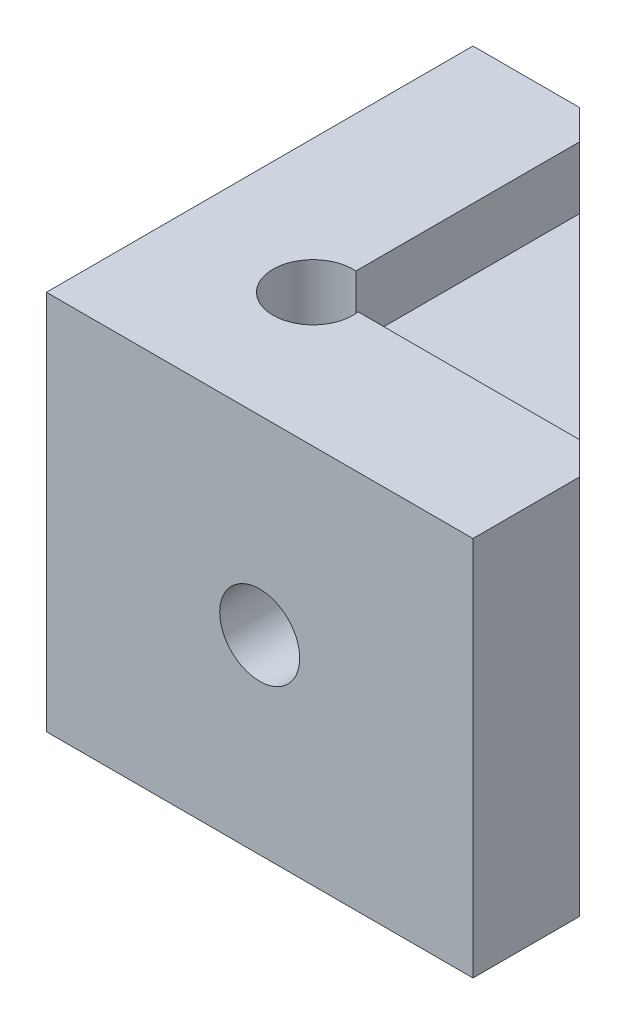
ISO-10303-21;
HEADER;
FILE_DESCRIPTION(('STEP AP214'),'2;1');
FILE_NAME('part.step','',(''),(''),'','','');
FILE_SCHEMA(('AUTOMOTIVE_DESIGN { 1 0 10303 214 1 1 1 1 }'));
ENDSEC;
DATA;
#1=APPLICATION_CONTEXT('core data for automotive mechanical design processes');
#2=APPLICATION_PROTOCOL_DEFINITION('international standard','automotive_design',2000,#1);
#3=PRODUCT_CONTEXT('',#1,'mechanical');
#4=PRODUCT('Part','Part','',(#3));
#5=PRODUCT_RELATED_PRODUCT_CATEGORY('part','',(#4));
#6=PRODUCT_DEFINITION_FORMATION('','',#4);
#7=PRODUCT_DEFINITION_CONTEXT('part definition',#1,'design');
#8=PRODUCT_DEFINITION('design','',#6,#7);
#9=PRODUCT_DEFINITION_SHAPE('','',#8);
#10=(LENGTH_UNIT() NAMED_UNIT(*) SI_UNIT(.MILLI.,.METRE.));
#11=(NAMED_UNIT(*) PLANE_ANGLE_UNIT() SI_UNIT($,.RADIAN.));
#12=(NAMED_UNIT(*) SI_UNIT($,.STERADIAN.) SOLID_ANGLE_UNIT());
#13=UNCERTAINTY_MEASURE_WITH_UNIT(LENGTH_MEASURE(1.E-05),#10,'distance_accuracy_value','');
#14=(GEOMETRIC_REPRESENTATION_CONTEXT(3) GLOBAL_UNCERTAINTY_ASSIGNED_CONTEXT((#13)) GLOBAL_UNIT_ASSIGNED_CONTEXT((#10,
#11,#12)) REPRESENTATION_CONTEXT('',''));
#15=CARTESIAN_POINT('',(0.,0.,0.));
#16=DIRECTION('',(0.,0.,1.));
#17=DIRECTION('',(1.,0.,0.));
#18=AXIS2_PLACEMENT_3D('',#15,#16,#17);
#19=CARTESIAN_POINT('',(55.6808607129772,22.7546875000257,-400019.05));
#20=DIRECTION('',(0.,1.,0.));
#21=DIRECTION('',(0.,0.,1.));
#22=AXIS2_PLACEMENT_3D('',#19,#20,#21);
#23=PLANE('',#22);
#24=DIRECTION('',(-1.,0.,0.));
#25=VECTOR('',#24,1.);
#26=CARTESIAN_POINT('',(55.6808607129772,22.7546875000399,-15.7275296228079));
#27=LINE('',#26,#25);
#28=CARTESIAN_POINT('',(31.8974703771942,22.7546875000406,-15.7275296228068));
#29=VERTEX_POINT('',#28);
#30=CARTESIAN_POINT('',(22.6016062652228,22.7546875000328,-15.7275296228043));
#31=VERTEX_POINT('',#30);
#32=EDGE_CURVE('E334',#29,#31,#27,.T.);
#33=ORIENTED_EDGE('',*,*,#32,.T.);
#34=DIRECTION('',(0.,0.,-1.));
#35=VECTOR('',#34,1.);
#36=CARTESIAN_POINT('',(22.6016062652236,22.7546875000257,-400019.05));
#37=LINE('',#36,#35);
#38=CARTESIAN_POINT('',(22.6016062652236,22.7546875000257,-22.3724703772064));
#39=VERTEX_POINT('',#38);
#40=EDGE_CURVE('E305',#31,#39,#37,.T.);
#41=ORIENTED_EDGE('',*,*,#40,.T.);
#42=DIRECTION('',(-1.,0.,0.));
#43=VECTOR('',#42,1.);
#44=CARTESIAN_POINT('',(55.6808607129772,22.7546875000826,-22.3724703771779));
#45=LINE('',#44,#43);
#46=CARTESIAN_POINT('',(25.2525296228234,22.7546875000822,-22.3724703771773));
#47=VERTEX_POINT('',#46);
#48=EDGE_CURVE('E352',#47,#39,#45,.T.);
#49=ORIENTED_EDGE('',*,*,#48,.F.);
#50=DIRECTION('',(-0.707106781186548,0.,-0.707106781186548));
#51=VECTOR('',#50,1.);
#52=CARTESIAN_POINT('',(9.525,22.7546875000257,-38.1));
#53=LINE('',#52,#51);
#54=EDGE_CURVE('E428',#29,#47,#53,.T.);
#55=ORIENTED_EDGE('',*,*,#54,.F.);
#56=EDGE_LOOP('',(#33,#41,#49,#55));
#57=FACE_BOUND('',#56,.T.);
#58=ADVANCED_FACE('F33',(#57),#23,.F.);
#59=CARTESIAN_POINT('',(55.6808607129772,11.2453125000229,-400019.05));
#60=DIRECTION('',(0.,-1.,0.));
#61=DIRECTION('',(0.,0.,-1.));
#62=AXIS2_PLACEMENT_3D('',#59,#60,#61);
#63=PLANE('',#62);
#64=DIRECTION('',(-1.,0.,0.));
#65=VECTOR('',#64,1.);
#66=CARTESIAN_POINT('',(55.6808607129772,11.2453125000229,-22.3724703771495));
#67=LINE('',#66,#65);
#68=CARTESIAN_POINT('',(25.2525296228591,11.2453125000254,-22.3724703771452));
#69=VERTEX_POINT('',#68);
#70=CARTESIAN_POINT('',(22.6016062653712,11.2453125000229,-22.3724703771495));
#71=VERTEX_POINT('',#70);
#72=EDGE_CURVE('E346',#69,#71,#67,.T.);
#73=ORIENTED_EDGE('',*,*,#72,.T.);
#74=DIRECTION('',(0.,0.,1.));
#75=VECTOR('',#74,1.);
#76=CARTESIAN_POINT('',(22.6016062653712,11.2453125000229,-400019.05));
#77=LINE('',#76,#75);
#78=CARTESIAN_POINT('',(22.6016062654537,11.2453125002503,-15.7275296226942));
#79=VERTEX_POINT('',#78);
#80=EDGE_CURVE('E284',#71,#79,#77,.T.);
#81=ORIENTED_EDGE('',*,*,#80,.T.);
#82=DIRECTION('',(-1.,0.,0.));
#83=VECTOR('',#82,1.);
#84=CARTESIAN_POINT('',(55.6808607129772,11.2453125001934,-15.7275296227226));
#85=LINE('',#84,#83);
#86=CARTESIAN_POINT('',(31.8974703772774,11.2453125001082,-15.7275296227226));
#87=VERTEX_POINT('',#86);
#88=EDGE_CURVE('E342',#87,#79,#85,.T.);
#89=ORIENTED_EDGE('',*,*,#88,.F.);
#90=DIRECTION('',(0.707106781186548,0.,0.707106781186548));
#91=VECTOR('',#90,1.);
#92=CARTESIAN_POINT('',(9.525,11.2453125000229,-38.1));
#93=LINE('',#92,#91);
#94=EDGE_CURVE('E425',#69,#87,#93,.T.);
#95=ORIENTED_EDGE('',*,*,#94,.F.);
#96=EDGE_LOOP('',(#73,#81,#89,#95));
#97=FACE_BOUND('',#96,.T.);
#98=ADVANCED_FACE('F492',(#97),#63,.F.);
#99=CARTESIAN_POINT('',(55.6808607129772,-45466.7715868621,26234.37282868));
#100=DIRECTION('',(0.,-0.5,-0.866025403784439));
#101=DIRECTION('',(0.,0.866025403784439,-0.5));
#102=AXIS2_PLACEMENT_3D('',#99,#100,#101);
#103=PLANE('',#102);
#104=DIRECTION('',(0.447213595499958,-0.774596669241483,0.447213595499958));
#105=VECTOR('',#104,1.);
#106=CARTESIAN_POINT('',(11.0790628016546,35.7944771537458,-36.5459371983454));
#107=LINE('',#106,#105);
#108=CARTESIAN_POINT('',(23.9270679441171,13.5410794710863,-23.6979320558811));
#109=VERTEX_POINT('',#108);
#110=EDGE_CURVE('E423',#109,#69,#107,.T.);
#111=ORIENTED_EDGE('',*,*,#110,.F.);
#112=DIRECTION('',(-0.447213595499958,-0.774596669241483,0.447213595499958));
#113=VECTOR('',#112,1.);
#114=CARTESIAN_POINT('',(-20976.1787820908,-36359.7092171138,20976.407917979));
#115=LINE('',#114,#113);
#116=EDGE_CURVE('E287',#109,#71,#115,.T.);
#117=ORIENTED_EDGE('',*,*,#116,.T.);
#118=ORIENTED_EDGE('',*,*,#72,.F.);
#119=EDGE_LOOP('',(#111,#117,#118));
#120=FACE_BOUND('',#119,.T.);
#121=ADVANCED_FACE('F499',(#120),#103,.F.);
#122=CARTESIAN_POINT('',(55.6808607129772,-391871.178413138,-226282.440239812));
#123=DIRECTION('',(0.,0.5,-0.866025403784439));
#124=DIRECTION('',(0.,0.866025403784439,0.5));
#125=AXIS2_PLACEMENT_3D('',#122,#123,#124);
#126=PLANE('',#125);
#127=ORIENTED_EDGE('',*,*,#48,.T.);
#128=DIRECTION('',(0.447213595499957,-0.774596669241484,-0.447213595499958));
#129=VECTOR('',#128,1.);
#130=CARTESIAN_POINT('',(181037.271672702,-313503.850782886,-181037.042536814));
#131=LINE('',#130,#129);
#132=CARTESIAN_POINT('',(23.9270679440374,20.4589205287984,-23.6979320560106));
#133=VERTEX_POINT('',#132);
#134=EDGE_CURVE('E308',#39,#133,#131,.T.);
#135=ORIENTED_EDGE('',*,*,#134,.T.);
#136=DIRECTION('',(-0.447213595499958,-0.774596669241484,-0.447213595499958));
#137=VECTOR('',#136,1.);
#138=CARTESIAN_POINT('',(22.8570082930636,18.6055228463229,-24.7679917069364));
#139=LINE('',#138,#137);
#140=EDGE_CURVE('E420',#47,#133,#139,.T.);
#141=ORIENTED_EDGE('',*,*,#140,.F.);
#142=EDGE_LOOP('',(#127,#135,#141));
#143=FACE_BOUND('',#142,.T.);
#144=ADVANCED_FACE('F560',(#143),#126,.F.);
#145=CARTESIAN_POINT('',(55.6808607129772,-45461.0168993623,26244.3402398116));
#146=DIRECTION('',(0.,0.5,0.866025403784439));
#147=DIRECTION('',(0.,-0.866025403784439,0.5));
#148=AXIS2_PLACEMENT_3D('',#145,#146,#147);
#149=PLANE('',#148);
#150=DIRECTION('',(-1.,0.,0.));
#151=VECTOR('',#150,1.);
#152=CARTESIAN_POINT('',(55.6808607129772,17.0000000001522,-12.4050592456442));
#153=LINE('',#152,#151);
#154=CARTESIAN_POINT('',(35.2199407544513,17.0000000001247,-12.4050592455964));
#155=VERTEX_POINT('',#154);
#156=CARTESIAN_POINT('',(25.9240766425473,17.0000000000741,-12.4050592456193));
#157=VERTEX_POINT('',#156);
#158=EDGE_CURVE('E341',#155,#157,#153,.T.);
#159=ORIENTED_EDGE('',*,*,#158,.T.);
#160=DIRECTION('',(-0.447213595499957,0.774596669241484,-0.447213595499958));
#161=VECTOR('',#160,1.);
#162=CARTESIAN_POINT('',(21037.2716727023,-36375.7215718658,20998.9425368143));
#163=LINE('',#162,#161);
#164=EDGE_CURVE('E440',#157,#31,#163,.T.);
#165=ORIENTED_EDGE('',*,*,#164,.T.);
#166=ORIENTED_EDGE('',*,*,#32,.F.);
#167=DIRECTION('',(-0.447213595499958,0.774596669241483,-0.447213595499958));
#168=VECTOR('',#167,1.);
#169=CARTESIAN_POINT('',(19.0529917069329,45.0019771536685,-28.5720082930671));
#170=LINE('',#169,#168);
#171=EDGE_CURVE('E357',#155,#29,#170,.T.);
#172=ORIENTED_EDGE('',*,*,#171,.F.);
#173=EDGE_LOOP('',(#159,#165,#166,#172));
#174=FACE_BOUND('',#173,.T.);
#175=ADVANCED_FACE('F564',(#174),#149,.F.);
#176=CARTESIAN_POINT('',(55.6808607129772,-391876.933100638,-226272.47282868));
#177=DIRECTION('',(0.,-0.5,0.866025403784439));
#178=DIRECTION('',(0.,-0.866025403784439,-0.5));
#179=AXIS2_PLACEMENT_3D('',#176,#177,#178);
#180=PLANE('',#179);
#181=ORIENTED_EDGE('',*,*,#88,.T.);
#182=DIRECTION('',(0.447213595499958,0.774596669241483,0.447213595499958));
#183=VECTOR('',#182,1.);
#184=CARTESIAN_POINT('',(-180976.178782091,-313487.838428134,-181014.507917979));
#185=LINE('',#184,#183);
#186=EDGE_CURVE('E434',#79,#157,#185,.T.);
#187=ORIENTED_EDGE('',*,*,#186,.T.);
#188=ORIENTED_EDGE('',*,*,#158,.F.);
#189=DIRECTION('',(0.447213595499958,0.774596669241483,0.447213595499958));
#190=VECTOR('',#189,1.);
#191=CARTESIAN_POINT('',(30.8309371983714,9.39802284636607,-16.7940628016286));
#192=LINE('',#191,#190);
#193=EDGE_CURVE('E337',#87,#155,#192,.T.);
#194=ORIENTED_EDGE('',*,*,#193,.F.);
#195=EDGE_LOOP('',(#181,#187,#188,#194));
#196=FACE_BOUND('',#195,.T.);
#197=ADVANCED_FACE('F567',(#196),#180,.F.);
#198=CARTESIAN_POINT('',(0.,34.,0.));
#199=DIRECTION('',(1.,0.,0.));
#200=DIRECTION('',(0.,0.,-1.));
#201=AXIS2_PLACEMENT_3D('',#198,#199,#200);
#202=PLANE('',#201);
#203=CARTESIAN_POINT('',(0.,17.,-19.05));
#204=DIRECTION('',(-1.,0.,0.));
#205=DIRECTION('',(0.,0.,1.));
#206=AXIS2_PLACEMENT_3D('',#203,#204,#205);
#207=CIRCLE('',#206,3.571875);
#208=CARTESIAN_POINT('',(0.,17.,-15.478125));
#209=VERTEX_POINT('',#208);
#210=EDGE_CURVE('E367',#209,#209,#207,.T.);
#211=ORIENTED_EDGE('',*,*,#210,.F.);
#212=EDGE_LOOP('',(#211));
#213=FACE_BOUND('',#212,.T.);
#214=DIRECTION('',(0.,0.,1.));
#215=VECTOR('',#214,1.);
#216=CARTESIAN_POINT('',(0.,0.,0.));
#217=LINE('',#216,#215);
#218=CARTESIAN_POINT('',(0.,0.,-38.1));
#219=VERTEX_POINT('',#218);
#220=CARTESIAN_POINT('',(0.,0.,0.));
#221=VERTEX_POINT('',#220);
#222=EDGE_CURVE('E389',#219,#221,#217,.T.);
#223=ORIENTED_EDGE('',*,*,#222,.T.);
#224=DIRECTION('',(0.,-1.,0.));
#225=VECTOR('',#224,1.);
#226=CARTESIAN_POINT('',(0.,34.,0.));
#227=LINE('',#226,#225);
#228=CARTESIAN_POINT('',(0.,34.,0.));
#229=VERTEX_POINT('',#228);
#230=EDGE_CURVE('E410',#229,#221,#227,.T.);
#231=ORIENTED_EDGE('',*,*,#230,.F.);
#232=DIRECTION('',(0.,0.,1.));
#233=VECTOR('',#232,1.);
#234=CARTESIAN_POINT('',(0.,34.,0.));
#235=LINE('',#234,#233);
#236=CARTESIAN_POINT('',(0.,34.,-38.1));
#237=VERTEX_POINT('',#236);
#238=EDGE_CURVE('E375',#237,#229,#235,.T.);
#239=ORIENTED_EDGE('',*,*,#238,.F.);
#240=DIRECTION('',(0.,-1.,0.));
#241=VECTOR('',#240,1.);
#242=CARTESIAN_POINT('',(0.,34.,-38.1));
#243=LINE('',#242,#241);
#244=EDGE_CURVE('E388',#237,#219,#243,.T.);
#245=ORIENTED_EDGE('',*,*,#244,.T.);
#246=EDGE_LOOP('',(#223,#231,#239,#245));
#247=FACE_BOUND('',#246,.T.);
#248=ADVANCED_FACE('F35',(#213,#247),#202,.F.);
#249=CARTESIAN_POINT('',(0.,34.,0.));
#250=DIRECTION('',(0.,0.,-1.));
#251=DIRECTION('',(-1.,0.,0.));
#252=AXIS2_PLACEMENT_3D('',#249,#250,#251);
#253=PLANE('',#252);
#254=CARTESIAN_POINT('',(19.05,17.,0.));
#255=DIRECTION('',(0.,0.,-1.));
#256=DIRECTION('',(-1.,0.,0.));
#257=AXIS2_PLACEMENT_3D('',#254,#255,#256);
#258=CIRCLE('',#257,3.571875);
#259=CARTESIAN_POINT('',(15.478125,17.,0.));
#260=VERTEX_POINT('',#259);
#261=EDGE_CURVE('E372',#260,#260,#258,.F.);
#262=ORIENTED_EDGE('',*,*,#261,.F.);
#263=EDGE_LOOP('',(#262));
#264=FACE_BOUND('',#263,.T.);
#265=DIRECTION('',(1.,0.,0.));
#266=VECTOR('',#265,1.);
#267=CARTESIAN_POINT('',(0.,0.,0.));
#268=LINE('',#267,#266);
#269=CARTESIAN_POINT('',(38.1,0.,0.));
#270=VERTEX_POINT('',#269);
#271=EDGE_CURVE('E392',#221,#270,#268,.T.);
#272=ORIENTED_EDGE('',*,*,#271,.T.);
#273=DIRECTION('',(0.,-1.,0.));
#274=VECTOR('',#273,1.);
#275=CARTESIAN_POINT('',(38.1,34.,0.));
#276=LINE('',#275,#274);
#277=CARTESIAN_POINT('',(38.1,34.,0.));
#278=VERTEX_POINT('',#277);
#279=EDGE_CURVE('E407',#278,#270,#276,.T.);
#280=ORIENTED_EDGE('',*,*,#279,.F.);
#281=DIRECTION('',(1.,0.,0.));
#282=VECTOR('',#281,1.);
#283=CARTESIAN_POINT('',(0.,34.,0.));
#284=LINE('',#283,#282);
#285=EDGE_CURVE('E378',#229,#278,#284,.T.);
#286=ORIENTED_EDGE('',*,*,#285,.F.);
#287=ORIENTED_EDGE('',*,*,#230,.T.);
#288=EDGE_LOOP('',(#272,#280,#286,#287));
#289=FACE_BOUND('',#288,.T.);
#290=ADVANCED_FACE('F480',(#264,#289),#253,.F.);
#291=CARTESIAN_POINT('',(38.1,34.,-9.525));
#292=DIRECTION('',(-1.,0.,0.));
#293=DIRECTION('',(0.,0.,1.));
#294=AXIS2_PLACEMENT_3D('',#291,#292,#293);
#295=PLANE('',#294);
#296=DIRECTION('',(0.,0.,-1.));
#297=VECTOR('',#296,1.);
#298=CARTESIAN_POINT('',(38.1,0.,-9.525));
#299=LINE('',#298,#297);
#300=CARTESIAN_POINT('',(38.1,0.,-9.525));
#301=VERTEX_POINT('',#300);
#302=EDGE_CURVE('E394',#270,#301,#299,.T.);
#303=ORIENTED_EDGE('',*,*,#302,.T.);
#304=DIRECTION('',(0.,-1.,0.));
#305=VECTOR('',#304,1.);
#306=CARTESIAN_POINT('',(38.1,34.,-9.525));
#307=LINE('',#306,#305);
#308=CARTESIAN_POINT('',(38.1,34.,-9.525));
#309=VERTEX_POINT('',#308);
#310=EDGE_CURVE('E404',#309,#301,#307,.T.);
#311=ORIENTED_EDGE('',*,*,#310,.F.);
#312=DIRECTION('',(0.,0.,-1.));
#313=VECTOR('',#312,1.);
#314=CARTESIAN_POINT('',(38.1,34.,-9.525));
#315=LINE('',#314,#313);
#316=EDGE_CURVE('E381',#278,#309,#315,.T.);
#317=ORIENTED_EDGE('',*,*,#316,.F.);
#318=ORIENTED_EDGE('',*,*,#279,.T.);
#319=EDGE_LOOP('',(#303,#311,#317,#318));
#320=FACE_BOUND('',#319,.T.);
#321=ADVANCED_FACE('F481',(#320),#295,.F.);
#322=CARTESIAN_POINT('',(9.525,34.,-38.1));
#323=DIRECTION('',(-0.707106781186547,0.,0.707106781186547));
#324=DIRECTION('',(0.707106781186548,0.,0.707106781186548));
#325=AXIS2_PLACEMENT_3D('',#322,#323,#324);
#326=PLANE('',#325);
#327=ORIENTED_EDGE('',*,*,#140,.T.);
#328=DIRECTION('',(-0.447213595499958,0.774596669241484,-0.447213595499958));
#329=VECTOR('',#328,1.);
#330=CARTESIAN_POINT('',(13.4754732397445,38.5616135767858,-34.1495267602555));
#331=LINE('',#330,#329);
#332=CARTESIAN_POINT('',(22.4870383212106,22.9531249999782,-25.1379616787917));
#333=VERTEX_POINT('',#332);
#334=EDGE_CURVE('E311',#133,#333,#331,.T.);
#335=ORIENTED_EDGE('',*,*,#334,.T.);
#336=DIRECTION('',(-0.707106781186548,0.,-0.707106781186548));
#337=VECTOR('',#336,1.);
#338=CARTESIAN_POINT('',(9.525,22.953125000015,-38.1));
#339=LINE('',#338,#337);
#340=CARTESIAN_POINT('',(15.6129616787537,22.9531250000727,-32.0120383212478));
#341=VERTEX_POINT('',#340);
#342=EDGE_CURVE('E446',#333,#341,#339,.T.);
#343=ORIENTED_EDGE('',*,*,#342,.T.);
#344=DIRECTION('',(-0.447213595499958,-0.774596669241483,-0.447213595499958));
#345=VECTOR('',#344,1.);
#346=CARTESIAN_POINT('',(17.0045267601983,25.363386423177,-30.6204732398017));
#347=LINE('',#346,#345);
#348=CARTESIAN_POINT('',(12.1759233574595,17.0000000000716,-35.4490766425239));
#349=VERTEX_POINT('',#348);
#350=EDGE_CURVE('E302',#341,#349,#347,.T.);
#351=ORIENTED_EDGE('',*,*,#350,.T.);
#352=DIRECTION('',(0.447213595499958,-0.774596669241484,0.447213595499958));
#353=VECTOR('',#352,1.);
#354=CARTESIAN_POINT('',(5.22658126876234,29.0366135768604,-42.3984187312377));
#355=LINE('',#354,#353);
#356=CARTESIAN_POINT('',(15.6129616787634,11.0468749999815,-32.0120383212284));
#357=VERTEX_POINT('',#356);
#358=EDGE_CURVE('E281',#349,#357,#355,.T.);
#359=ORIENTED_EDGE('',*,*,#358,.T.);
#360=DIRECTION('',(0.707106781186548,0.,0.707106781186548));
#361=VECTOR('',#360,1.);
#362=CARTESIAN_POINT('',(9.525,11.0468749999768,-38.1));
#363=LINE('',#362,#361);
#364=CARTESIAN_POINT('',(22.4870383213442,11.0468750000052,-25.1379616786558));
#365=VERTEX_POINT('',#364);
#366=EDGE_CURVE('E443',#357,#365,#363,.T.);
#367=ORIENTED_EDGE('',*,*,#366,.T.);
#368=DIRECTION('',(0.447213595499958,0.774596669241483,0.447213595499958));
#369=VECTOR('',#368,1.);
#370=CARTESIAN_POINT('',(25.2534187312913,15.8383864231237,-22.3715812687087));
#371=LINE('',#370,#369);
#372=EDGE_CURVE('E290',#365,#109,#371,.T.);
#373=ORIENTED_EDGE('',*,*,#372,.T.);
#374=ORIENTED_EDGE('',*,*,#110,.T.);
#375=ORIENTED_EDGE('',*,*,#94,.T.);
#376=ORIENTED_EDGE('',*,*,#193,.T.);
#377=ORIENTED_EDGE('',*,*,#171,.T.);
#378=ORIENTED_EDGE('',*,*,#54,.T.);
#379=EDGE_LOOP('',(#327,#335,#343,#351,#359,#367,#373,#374,#375,#376,#377,#378));
#380=FACE_BOUND('',#379,.T.);
#381=DIRECTION('',(-0.707106781187534,0.,-0.707106781185561));
#382=VECTOR('',#381,1.);
#383=CARTESIAN_POINT('',(35.2199407544513,28.44375,-12.4050592455964));
#384=LINE('',#383,#382);
#385=CARTESIAN_POINT('',(35.2199407544513,28.44375,-12.4050592455964));
#386=VERTEX_POINT('',#385);
#387=CARTESIAN_POINT('',(12.1759233574595,28.44375,-35.4490766425239));
#388=VERTEX_POINT('',#387);
#389=EDGE_CURVE('E223',#386,#388,#384,.T.);
#390=ORIENTED_EDGE('',*,*,#389,.F.);
#391=DIRECTION('',(0.,1.,0.));
#392=VECTOR('',#391,1.);
#393=CARTESIAN_POINT('',(35.2199407544513,28.44375,-12.4050592455964));
#394=LINE('',#393,#392);
#395=CARTESIAN_POINT('',(35.2199407544513,34.,-12.4050592455964));
#396=VERTEX_POINT('',#395);
#397=EDGE_CURVE('E237',#386,#396,#394,.T.);
#398=ORIENTED_EDGE('',*,*,#397,.T.);
#399=DIRECTION('',(-0.707106781186548,0.,-0.707106781186548));
#400=VECTOR('',#399,1.);
#401=CARTESIAN_POINT('',(9.525,34.,-38.1));
#402=LINE('',#401,#400);
#403=EDGE_CURVE('E383',#309,#396,#402,.T.);
#404=ORIENTED_EDGE('',*,*,#403,.F.);
#405=ORIENTED_EDGE('',*,*,#310,.T.);
#406=DIRECTION('',(-0.707106781186548,0.,-0.707106781186548));
#407=VECTOR('',#406,1.);
#408=CARTESIAN_POINT('',(9.525,0.,-38.1));
#409=LINE('',#408,#407);
#410=CARTESIAN_POINT('',(9.525,0.,-38.1));
#411=VERTEX_POINT('',#410);
#412=EDGE_CURVE('E396',#301,#411,#409,.T.);
#413=ORIENTED_EDGE('',*,*,#412,.T.);
#414=DIRECTION('',(0.,-1.,0.));
#415=VECTOR('',#414,1.);
#416=CARTESIAN_POINT('',(9.525,34.,-38.1));
#417=LINE('',#416,#415);
#418=CARTESIAN_POINT('',(9.525,34.,-38.1));
#419=VERTEX_POINT('',#418);
#420=EDGE_CURVE('E401',#419,#411,#417,.T.);
#421=ORIENTED_EDGE('',*,*,#420,.F.);
#422=CARTESIAN_POINT('',(12.1759233574595,34.,-35.4490766425239));
#423=VERTEX_POINT('',#422);
#424=EDGE_CURVE('E236',#423,#419,#402,.T.);
#425=ORIENTED_EDGE('',*,*,#424,.F.);
#426=DIRECTION('',(0.,1.,0.));
#427=VECTOR('',#426,1.);
#428=CARTESIAN_POINT('',(12.1759233574595,28.44375,-35.4490766425239));
#429=LINE('',#428,#427);
#430=EDGE_CURVE('E218',#388,#423,#429,.T.);
#431=ORIENTED_EDGE('',*,*,#430,.F.);
#432=EDGE_LOOP('',(#390,#398,#404,#405,#413,#421,#425,#431));
#433=FACE_BOUND('',#432,.T.);
#434=ADVANCED_FACE('F234',(#380,#433),#326,.F.);
#435=CARTESIAN_POINT('',(0.,34.,-38.1));
#436=DIRECTION('',(0.,0.,1.));
#437=DIRECTION('',(1.,0.,0.));
#438=AXIS2_PLACEMENT_3D('',#435,#436,#437);
#439=PLANE('',#438);
#440=DIRECTION('',(-1.,0.,0.));
#441=VECTOR('',#440,1.);
#442=CARTESIAN_POINT('',(0.,0.,-38.1));
#443=LINE('',#442,#441);
#444=EDGE_CURVE('E379',#411,#219,#443,.T.);
#445=ORIENTED_EDGE('',*,*,#444,.T.);
#446=ORIENTED_EDGE('',*,*,#244,.F.);
#447=DIRECTION('',(-1.,0.,0.));
#448=VECTOR('',#447,1.);
#449=CARTESIAN_POINT('',(0.,34.,-38.1));
#450=LINE('',#449,#448);
#451=EDGE_CURVE('E386',#419,#237,#450,.T.);
#452=ORIENTED_EDGE('',*,*,#451,.F.);
#453=ORIENTED_EDGE('',*,*,#420,.T.);
#454=EDGE_LOOP('',(#445,#446,#452,#453));
#455=FACE_BOUND('',#454,.T.);
#456=ADVANCED_FACE('F473',(#455),#439,.F.);
#457=CARTESIAN_POINT('',(0.,34.,0.));
#458=DIRECTION('',(0.,-1.,0.));
#459=DIRECTION('',(0.,0.,-1.));
#460=AXIS2_PLACEMENT_3D('',#457,#458,#459);
#461=PLANE('',#460);
#462=ORIENTED_EDGE('',*,*,#403,.T.);
#463=DIRECTION('',(1.,0.,2.46206488338886E-12));
#464=VECTOR('',#463,1.);
#465=CARTESIAN_POINT('',(35.2199407544513,34.,-12.4050592455964));
#466=LINE('',#465,#464);
#467=CARTESIAN_POINT('',(15.4431243760677,34.,-12.4050592456451));
#468=VERTEX_POINT('',#467);
#469=EDGE_CURVE('E231',#468,#396,#466,.T.);
#470=ORIENTED_EDGE('',*,*,#469,.F.);
#471=CARTESIAN_POINT('',(11.90625,34.,-11.90625));
#472=DIRECTION('',(0.,-1.,0.));
#473=DIRECTION('',(0.,0.,-1.));
#474=AXIS2_PLACEMENT_3D('',#471,#472,#473);
#475=CIRCLE('',#474,3.571875);
#476=CARTESIAN_POINT('',(12.175923357473,34.,-15.4679304033903));
#477=VERTEX_POINT('',#476);
#478=EDGE_CURVE('E364',#468,#477,#475,.T.);
#479=ORIENTED_EDGE('',*,*,#478,.T.);
#480=DIRECTION('',(6.71109534504747E-13,0.,1.));
#481=VECTOR('',#480,1.);
#482=CARTESIAN_POINT('',(12.1759233574595,34.,-35.4490766425239));
#483=LINE('',#482,#481);
#484=EDGE_CURVE('E457',#423,#477,#483,.T.);
#485=ORIENTED_EDGE('',*,*,#484,.F.);
#486=ORIENTED_EDGE('',*,*,#424,.T.);
#487=ORIENTED_EDGE('',*,*,#451,.T.);
#488=ORIENTED_EDGE('',*,*,#238,.T.);
#489=ORIENTED_EDGE('',*,*,#285,.T.);
#490=ORIENTED_EDGE('',*,*,#316,.T.);
#491=EDGE_LOOP('',(#462,#470,#479,#485,#486,#487,#488,#489,#490));
#492=FACE_BOUND('',#491,.T.);
#493=ADVANCED_FACE('F456',(#492),#461,.F.);
#494=CARTESIAN_POINT('',(0.,0.,0.));
#495=DIRECTION('',(0.,-1.,0.));
#496=DIRECTION('',(0.,0.,-1.));
#497=AXIS2_PLACEMENT_3D('',#494,#495,#496);
#498=PLANE('',#497);
#499=CARTESIAN_POINT('',(11.90625,0.,-11.90625));
#500=DIRECTION('',(0.,1.,0.));
#501=DIRECTION('',(0.,0.,1.));
#502=AXIS2_PLACEMENT_3D('',#499,#500,#501);
#503=CIRCLE('',#502,3.571875);
#504=CARTESIAN_POINT('',(11.90625,0.,-8.334375));
#505=VERTEX_POINT('',#504);
#506=EDGE_CURVE('E361',#505,#505,#503,.T.);
#507=ORIENTED_EDGE('',*,*,#506,.T.);
#508=EDGE_LOOP('',(#507));
#509=FACE_BOUND('',#508,.T.);
#510=ORIENTED_EDGE('',*,*,#222,.F.);
#511=ORIENTED_EDGE('',*,*,#444,.F.);
#512=ORIENTED_EDGE('',*,*,#412,.F.);
#513=ORIENTED_EDGE('',*,*,#302,.F.);
#514=ORIENTED_EDGE('',*,*,#271,.F.);
#515=EDGE_LOOP('',(#510,#511,#512,#513,#514));
#516=FACE_BOUND('',#515,.T.);
#517=ADVANCED_FACE('F470',(#509,#516),#498,.T.);
#518=CARTESIAN_POINT('',(19.05,17.,1.2E-05));
#519=DIRECTION('',(0.,0.,-1.));
#520=DIRECTION('',(-1.,0.,0.));
#521=AXIS2_PLACEMENT_3D('',#518,#519,#520);
#522=CYLINDRICAL_SURFACE('',#521,3.571875);
#523=CARTESIAN_POINT('',(19.05,17.,-5.55625));
#524=DIRECTION('',(0.,0.,1.));
#525=DIRECTION('',(1.,0.,0.));
#526=AXIS2_PLACEMENT_3D('',#523,#524,#525);
#527=CIRCLE('',#526,3.571875);
#528=CARTESIAN_POINT('',(22.621875,17.,-5.55625));
#529=VERTEX_POINT('',#528);
#530=EDGE_CURVE('E314',#529,#529,#527,.T.);
#531=ORIENTED_EDGE('',*,*,#530,.F.);
#532=EDGE_LOOP('',(#531));
#533=FACE_BOUND('',#532,.T.);
#534=ORIENTED_EDGE('',*,*,#261,.T.);
#535=EDGE_LOOP('',(#534));
#536=FACE_BOUND('',#535,.T.);
#537=ADVANCED_FACE('F637',(#533,#536),#522,.F.);
#538=CARTESIAN_POINT('',(5.55625,17.,-19.05));
#539=DIRECTION('',(-1.,0.,0.));
#540=DIRECTION('',(0.,0.,1.));
#541=AXIS2_PLACEMENT_3D('',#538,#539,#540);
#542=CYLINDRICAL_SURFACE('',#541,3.571875);
#543=CARTESIAN_POINT('',(5.55625,17.,-19.05));
#544=DIRECTION('',(-1.,0.,0.));
#545=DIRECTION('',(0.,0.,1.));
#546=AXIS2_PLACEMENT_3D('',#543,#544,#545);
#547=CIRCLE('',#546,3.571875);
#548=CARTESIAN_POINT('',(5.55625,17.,-15.478125));
#549=VERTEX_POINT('',#548);
#550=EDGE_CURVE('E360',#549,#549,#547,.T.);
#551=ORIENTED_EDGE('',*,*,#550,.F.);
#552=EDGE_LOOP('',(#551));
#553=FACE_BOUND('',#552,.T.);
#554=ORIENTED_EDGE('',*,*,#210,.T.);
#555=EDGE_LOOP('',(#554));
#556=FACE_BOUND('',#555,.T.);
#557=ADVANCED_FACE('F513',(#553,#556),#542,.F.);
#558=CARTESIAN_POINT('',(11.90625,0.,-11.90625));
#559=DIRECTION('',(0.,1.,0.));
#560=DIRECTION('',(0.,0.,1.));
#561=AXIS2_PLACEMENT_3D('',#558,#559,#560);
#562=CYLINDRICAL_SURFACE('',#561,3.571875);
#563=ORIENTED_EDGE('',*,*,#478,.F.);
#564=DIRECTION('',(0.,1.,0.));
#565=VECTOR('',#564,1.);
#566=CARTESIAN_POINT('',(15.4431243760677,0.,-12.4050592456451));
#567=LINE('',#566,#565);
#568=CARTESIAN_POINT('',(15.4431243760677,28.44375,-12.4050592456451));
#569=VERTEX_POINT('',#568);
#570=EDGE_CURVE('E11',#468,#569,#567,.F.);
#571=ORIENTED_EDGE('',*,*,#570,.T.);
#572=CARTESIAN_POINT('',(11.90625,28.44375,-11.90625));
#573=DIRECTION('',(0.,1.,0.));
#574=DIRECTION('',(0.,0.,1.));
#575=AXIS2_PLACEMENT_3D('',#572,#573,#574);
#576=CIRCLE('',#575,3.571875);
#577=CARTESIAN_POINT('',(12.175923357473,28.44375,-15.4679304033903));
#578=VERTEX_POINT('',#577);
#579=EDGE_CURVE('E449',#578,#569,#576,.F.);
#580=ORIENTED_EDGE('',*,*,#579,.F.);
#581=DIRECTION('',(0.,1.,0.));
#582=VECTOR('',#581,1.);
#583=CARTESIAN_POINT('',(12.175923357473,0.,-15.4679304033903));
#584=LINE('',#583,#582);
#585=EDGE_CURVE('E41',#578,#477,#584,.T.);
#586=ORIENTED_EDGE('',*,*,#585,.T.);
#587=EDGE_LOOP('',(#563,#571,#580,#586));
#588=FACE_BOUND('',#587,.T.);
#589=CARTESIAN_POINT('',(11.90625,16.5329120434876,-11.90625));
#590=DIRECTION('',(-0.866025403784438,0.5,0.));
#591=DIRECTION('',(0.5,0.866025403784439,0.));
#592=AXIS2_PLACEMENT_3D('',#589,#590,#591);
#593=ELLIPSE('',#592,7.14375,3.571875);
#594=CARTESIAN_POINT('',(14.314779298207,20.7046071594874,-14.54391518633));
#595=VERTEX_POINT('',#594);
#596=CARTESIAN_POINT('',(12.175923357443,17.0000000000812,-8.34456959660925));
#597=VERTEX_POINT('',#596);
#598=EDGE_CURVE('E296',#595,#597,#593,.F.);
#599=ORIENTED_EDGE('',*,*,#598,.T.);
#600=CARTESIAN_POINT('',(11.90625,17.467087956625,-11.90625));
#601=DIRECTION('',(-0.866025403784439,-0.5,0.));
#602=DIRECTION('',(-0.5,0.866025403784439,0.));
#603=AXIS2_PLACEMENT_3D('',#600,#601,#602);
#604=ELLIPSE('',#603,7.14375000000001,3.571875);
#605=CARTESIAN_POINT('',(14.3147792983598,13.2953928402912,-14.5439151864935));
#606=VERTEX_POINT('',#605);
#607=EDGE_CURVE('E275',#597,#606,#604,.F.);
#608=ORIENTED_EDGE('',*,*,#607,.T.);
#609=CARTESIAN_POINT('',(11.90625,17.8639629566533,-11.90625));
#610=DIRECTION('',(0.,-0.5,0.866025403784439));
#611=DIRECTION('',(0.,0.866025403784439,0.5));
#612=AXIS2_PLACEMENT_3D('',#609,#610,#611);
#613=ELLIPSE('',#612,7.14375,3.571875);
#614=CARTESIAN_POINT('',(8.36937562391759,17.0000000001522,-12.4050592456442));
#615=VERTEX_POINT('',#614);
#616=EDGE_CURVE('E413',#606,#615,#613,.F.);
#617=ORIENTED_EDGE('',*,*,#616,.T.);
#618=CARTESIAN_POINT('',(11.90625,16.1360370434096,-11.90625));
#619=DIRECTION('',(0.,0.5,0.866025403784439));
#620=DIRECTION('',(0.,0.866025403784439,-0.5));
#621=AXIS2_PLACEMENT_3D('',#618,#619,#620);
#622=ELLIPSE('',#621,7.14375,3.571875);
#623=EDGE_CURVE('E417',#615,#595,#622,.F.);
#624=ORIENTED_EDGE('',*,*,#623,.T.);
#625=EDGE_LOOP('',(#599,#608,#617,#624));
#626=FACE_BOUND('',#625,.T.);
#627=ORIENTED_EDGE('',*,*,#506,.F.);
#628=EDGE_LOOP('',(#627));
#629=FACE_BOUND('',#628,.T.);
#630=ADVANCED_FACE('F452',(#588,#626,#629),#562,.F.);
#631=CARTESIAN_POINT('',(15.4983937346723,22.7546875000257,-22.3724703772064));
#632=VERTEX_POINT('',#631);
#633=CARTESIAN_POINT('',(5.55625,22.7546875000826,-22.3724703771779));
#634=VERTEX_POINT('',#633);
#635=EDGE_CURVE('E333',#632,#634,#45,.T.);
#636=ORIENTED_EDGE('',*,*,#635,.F.);
#637=DIRECTION('',(0.,0.,1.));
#638=VECTOR('',#637,1.);
#639=CARTESIAN_POINT('',(15.4983937346723,22.7546875000257,-400019.05));
#640=LINE('',#639,#638);
#641=CARTESIAN_POINT('',(15.4983937346849,22.7546875000399,-15.7275296228079));
#642=VERTEX_POINT('',#641);
#643=EDGE_CURVE('E293',#632,#642,#640,.T.);
#644=ORIENTED_EDGE('',*,*,#643,.T.);
#645=CARTESIAN_POINT('',(5.55625,22.7546875000399,-15.7275296228079));
#646=VERTEX_POINT('',#645);
#647=EDGE_CURVE('E338',#642,#646,#27,.T.);
#648=ORIENTED_EDGE('',*,*,#647,.T.);
#649=DIRECTION('',(0.,0.,-1.));
#650=VECTOR('',#649,1.);
#651=CARTESIAN_POINT('',(5.55625,22.7546875000257,-400019.05));
#652=LINE('',#651,#650);
#653=EDGE_CURVE('E315',#646,#634,#652,.T.);
#654=ORIENTED_EDGE('',*,*,#653,.T.);
#655=EDGE_LOOP('',(#636,#644,#648,#654));
#656=FACE_BOUND('',#655,.T.);
#657=ADVANCED_FACE('F495',(#656),#23,.F.);
#658=CARTESIAN_POINT('',(15.4983937346183,11.245312500165,-15.7275296227368));
#659=VERTEX_POINT('',#658);
#660=CARTESIAN_POINT('',(5.55625,11.2453125001934,-15.7275296227226));
#661=VERTEX_POINT('',#660);
#662=EDGE_CURVE('E345',#659,#661,#85,.T.);
#663=ORIENTED_EDGE('',*,*,#662,.F.);
#664=DIRECTION('',(0.,0.,-1.));
#665=VECTOR('',#664,1.);
#666=CARTESIAN_POINT('',(15.4983937347052,11.2453125000229,-400019.05));
#667=LINE('',#666,#665);
#668=CARTESIAN_POINT('',(15.4983937347052,11.2453125000229,-22.3724703771495));
#669=VERTEX_POINT('',#668);
#670=EDGE_CURVE('E263',#659,#669,#667,.T.);
#671=ORIENTED_EDGE('',*,*,#670,.T.);
#672=CARTESIAN_POINT('',(5.55625,11.2453125000229,-22.3724703771495));
#673=VERTEX_POINT('',#672);
#674=EDGE_CURVE('E349',#669,#673,#67,.T.);
#675=ORIENTED_EDGE('',*,*,#674,.T.);
#676=DIRECTION('',(0.,0.,1.));
#677=VECTOR('',#676,1.);
#678=CARTESIAN_POINT('',(5.55625,11.2453125000229,-400019.05));
#679=LINE('',#678,#677);
#680=EDGE_CURVE('E324',#673,#661,#679,.T.);
#681=ORIENTED_EDGE('',*,*,#680,.T.);
#682=EDGE_LOOP('',(#663,#671,#675,#681));
#683=FACE_BOUND('',#682,.T.);
#684=ADVANCED_FACE('F502',(#683),#63,.F.);
#685=ORIENTED_EDGE('',*,*,#674,.F.);
#686=DIRECTION('',(-0.447213595499958,0.774596669241483,-0.447213595499958));
#687=VECTOR('',#686,1.);
#688=CARTESIAN_POINT('',(21028.931126376,-36385.0878218657,20991.0602622642));
#689=LINE('',#688,#687);
#690=CARTESIAN_POINT('',(12.1759233574661,17.000000000067,-25.6949407543598));
#691=VERTEX_POINT('',#690);
#692=EDGE_CURVE('E278',#669,#691,#689,.T.);
#693=ORIENTED_EDGE('',*,*,#692,.T.);
#694=DIRECTION('',(-1.,0.,0.));
#695=VECTOR('',#694,1.);
#696=CARTESIAN_POINT('',(55.6808607129772,17.0000000001025,-25.6949407544127));
#697=LINE('',#696,#695);
#698=CARTESIAN_POINT('',(5.55625,17.0000000001025,-25.6949407544127));
#699=VERTEX_POINT('',#698);
#700=EDGE_CURVE('E350',#691,#699,#697,.T.);
#701=ORIENTED_EDGE('',*,*,#700,.T.);
#702=DIRECTION('',(0.,-0.866025403784439,0.5));
#703=VECTOR('',#702,1.);
#704=CARTESIAN_POINT('',(5.55625,-45466.7715868621,26234.37282868));
#705=LINE('',#704,#703);
#706=EDGE_CURVE('E321',#699,#673,#705,.T.);
#707=ORIENTED_EDGE('',*,*,#706,.T.);
#708=EDGE_LOOP('',(#685,#693,#701,#707));
#709=FACE_BOUND('',#708,.T.);
#710=ADVANCED_FACE('F511',(#709),#103,.F.);
#711=ORIENTED_EDGE('',*,*,#700,.F.);
#712=DIRECTION('',(0.447213595499958,0.774596669241483,0.447213595499958));
#713=VECTOR('',#712,1.);
#714=CARTESIAN_POINT('',(-180984.519328417,-313478.472178134,-181022.390192529));
#715=LINE('',#714,#713);
#716=EDGE_CURVE('E299',#691,#632,#715,.T.);
#717=ORIENTED_EDGE('',*,*,#716,.T.);
#718=ORIENTED_EDGE('',*,*,#635,.T.);
#719=DIRECTION('',(0.,-0.866025403784439,-0.5));
#720=VECTOR('',#719,1.);
#721=CARTESIAN_POINT('',(5.55625,-391871.178413138,-226282.440239812));
#722=LINE('',#721,#720);
#723=EDGE_CURVE('E318',#634,#699,#722,.T.);
#724=ORIENTED_EDGE('',*,*,#723,.T.);
#725=EDGE_LOOP('',(#711,#717,#718,#724));
#726=FACE_BOUND('',#725,.T.);
#727=ADVANCED_FACE('F520',(#726),#126,.F.);
#728=ORIENTED_EDGE('',*,*,#647,.F.);
#729=DIRECTION('',(-0.447213595499958,-0.774596669241483,0.447213595499958));
#730=VECTOR('',#729,1.);
#731=CARTESIAN_POINT('',(-20984.5193284172,-36350.3429671138,20984.2901925291));
#732=LINE('',#731,#730);
#733=EDGE_CURVE('E437',#642,#595,#732,.T.);
#734=ORIENTED_EDGE('',*,*,#733,.T.);
#735=ORIENTED_EDGE('',*,*,#623,.F.);
#736=CARTESIAN_POINT('',(5.55625,17.0000000001522,-12.4050592456442));
#737=VERTEX_POINT('',#736);
#738=EDGE_CURVE('E339',#615,#737,#153,.T.);
#739=ORIENTED_EDGE('',*,*,#738,.T.);
#740=DIRECTION('',(0.,0.866025403784439,-0.5));
#741=VECTOR('',#740,1.);
#742=CARTESIAN_POINT('',(5.55625,-45461.0168993623,26244.3402398116));
#743=LINE('',#742,#741);
#744=EDGE_CURVE('E330',#737,#646,#743,.T.);
#745=ORIENTED_EDGE('',*,*,#744,.T.);
#746=EDGE_LOOP('',(#728,#734,#735,#739,#745));
#747=FACE_BOUND('',#746,.T.);
#748=ADVANCED_FACE('F539',(#747),#149,.F.);
#749=ORIENTED_EDGE('',*,*,#616,.F.);
#750=DIRECTION('',(0.447213595499958,-0.774596669241483,-0.447213595499958));
#751=VECTOR('',#750,1.);
#752=CARTESIAN_POINT('',(181028.931126376,-313513.217032886,-181029.160262264));
#753=LINE('',#752,#751);
#754=EDGE_CURVE('E431',#606,#659,#753,.T.);
#755=ORIENTED_EDGE('',*,*,#754,.T.);
#756=ORIENTED_EDGE('',*,*,#662,.T.);
#757=DIRECTION('',(0.,0.866025403784439,0.5));
#758=VECTOR('',#757,1.);
#759=CARTESIAN_POINT('',(5.55625,-391876.933100638,-226272.47282868));
#760=LINE('',#759,#758);
#761=EDGE_CURVE('E327',#661,#737,#760,.T.);
#762=ORIENTED_EDGE('',*,*,#761,.T.);
#763=ORIENTED_EDGE('',*,*,#738,.F.);
#764=EDGE_LOOP('',(#749,#755,#756,#762,#763));
#765=FACE_BOUND('',#764,.T.);
#766=ADVANCED_FACE('F536',(#765),#180,.F.);
#767=CARTESIAN_POINT('',(5.55625,0.,0.));
#768=DIRECTION('',(-1.,0.,0.));
#769=DIRECTION('',(0.,0.,1.));
#770=AXIS2_PLACEMENT_3D('',#767,#768,#769);
#771=PLANE('',#770);
#772=ORIENTED_EDGE('',*,*,#550,.T.);
#773=EDGE_LOOP('',(#772));
#774=FACE_BOUND('',#773,.T.);
#775=ORIENTED_EDGE('',*,*,#653,.F.);
#776=ORIENTED_EDGE('',*,*,#744,.F.);
#777=ORIENTED_EDGE('',*,*,#761,.F.);
#778=ORIENTED_EDGE('',*,*,#680,.F.);
#779=ORIENTED_EDGE('',*,*,#706,.F.);
#780=ORIENTED_EDGE('',*,*,#723,.F.);
#781=EDGE_LOOP('',(#775,#776,#777,#778,#779,#780));
#782=FACE_BOUND('',#781,.T.);
#783=ADVANCED_FACE('F523',(#774,#782),#771,.F.);
#784=CARTESIAN_POINT('',(-399980.95,22.953125000015,-56.2870972893998));
#785=DIRECTION('',(0.,1.,0.));
#786=DIRECTION('',(0.,0.,1.));
#787=AXIS2_PLACEMENT_3D('',#784,#785,#786);
#788=PLANE('',#787);
#789=DIRECTION('',(0.,0.,1.));
#790=VECTOR('',#789,1.);
#791=CARTESIAN_POINT('',(22.4870383212128,22.9531249999795,-56.2870972893998));
#792=LINE('',#791,#790);
#793=CARTESIAN_POINT('',(22.4870383212128,22.9531249999795,-5.55625));
#794=VERTEX_POINT('',#793);
#795=EDGE_CURVE('E261',#333,#794,#792,.T.);
#796=ORIENTED_EDGE('',*,*,#795,.T.);
#797=DIRECTION('',(-1.,0.,0.));
#798=VECTOR('',#797,1.);
#799=CARTESIAN_POINT('',(-399980.95,22.953125000015,-5.55625));
#800=LINE('',#799,#798);
#801=CARTESIAN_POINT('',(15.6129616787553,22.9531250000719,-5.55625));
#802=VERTEX_POINT('',#801);
#803=EDGE_CURVE('E239',#794,#802,#800,.T.);
#804=ORIENTED_EDGE('',*,*,#803,.T.);
#805=DIRECTION('',(0.,0.,1.));
#806=VECTOR('',#805,1.);
#807=CARTESIAN_POINT('',(15.6129616787553,22.9531250000719,-56.2870972893998));
#808=LINE('',#807,#806);
#809=EDGE_CURVE('E260',#341,#802,#808,.T.);
#810=ORIENTED_EDGE('',*,*,#809,.F.);
#811=ORIENTED_EDGE('',*,*,#342,.F.);
#812=EDGE_LOOP('',(#796,#804,#810,#811));
#813=FACE_BOUND('',#812,.T.);
#814=ADVANCED_FACE('F554',(#813),#788,.F.);
#815=CARTESIAN_POINT('',(-399980.95,11.0468749999768,-56.2870972893998));
#816=DIRECTION('',(0.,-1.,0.));
#817=DIRECTION('',(0.,0.,-1.));
#818=AXIS2_PLACEMENT_3D('',#815,#816,#817);
#819=PLANE('',#818);
#820=DIRECTION('',(0.,0.,1.));
#821=VECTOR('',#820,1.);
#822=CARTESIAN_POINT('',(15.6129616787553,11.0468749999768,-56.2870972893998));
#823=LINE('',#822,#821);
#824=CARTESIAN_POINT('',(15.6129616787553,11.0468749999768,-5.55625));
#825=VERTEX_POINT('',#824);
#826=EDGE_CURVE('E267',#357,#825,#823,.T.);
#827=ORIENTED_EDGE('',*,*,#826,.T.);
#828=DIRECTION('',(1.,0.,0.));
#829=VECTOR('',#828,1.);
#830=CARTESIAN_POINT('',(-399980.95,11.0468749999768,-5.55625));
#831=LINE('',#830,#829);
#832=CARTESIAN_POINT('',(22.4870383213442,11.0468750000337,-5.55625));
#833=VERTEX_POINT('',#832);
#834=EDGE_CURVE('E252',#825,#833,#831,.T.);
#835=ORIENTED_EDGE('',*,*,#834,.T.);
#836=DIRECTION('',(0.,0.,1.));
#837=VECTOR('',#836,1.);
#838=CARTESIAN_POINT('',(22.4870383213442,11.0468750000337,-56.2870972893998));
#839=LINE('',#838,#837);
#840=EDGE_CURVE('E265',#365,#833,#839,.T.);
#841=ORIENTED_EDGE('',*,*,#840,.F.);
#842=ORIENTED_EDGE('',*,*,#366,.F.);
#843=EDGE_LOOP('',(#827,#835,#841,#842));
#844=FACE_BOUND('',#843,.T.);
#845=ADVANCED_FACE('F577',(#844),#819,.F.);
#846=CARTESIAN_POINT('',(26282.6120917277,-45460.9176806126,-56.2870972893998));
#847=DIRECTION('',(0.866025403784439,0.5,0.));
#848=DIRECTION('',(-0.5,0.866025403784439,0.));
#849=AXIS2_PLACEMENT_3D('',#846,#847,#848);
#850=PLANE('',#849);
#851=ORIENTED_EDGE('',*,*,#134,.F.);
#852=ORIENTED_EDGE('',*,*,#40,.F.);
#853=ORIENTED_EDGE('',*,*,#164,.F.);
#854=DIRECTION('',(0.,0.,1.));
#855=VECTOR('',#854,1.);
#856=CARTESIAN_POINT('',(25.9240766424966,16.9999999999604,-56.2870972893998));
#857=LINE('',#856,#855);
#858=CARTESIAN_POINT('',(25.9240766424966,16.9999999999604,-5.55625));
#859=VERTEX_POINT('',#858);
#860=EDGE_CURVE('E56',#157,#859,#857,.T.);
#861=ORIENTED_EDGE('',*,*,#860,.T.);
#862=DIRECTION('',(-0.5,0.866025403784439,0.));
#863=VECTOR('',#862,1.);
#864=CARTESIAN_POINT('',(26282.6120917277,-45460.9176806126,-5.55625));
#865=LINE('',#864,#863);
#866=EDGE_CURVE('E257',#859,#794,#865,.T.);
#867=ORIENTED_EDGE('',*,*,#866,.T.);
#868=ORIENTED_EDGE('',*,*,#795,.F.);
#869=ORIENTED_EDGE('',*,*,#334,.F.);
#870=EDGE_LOOP('',(#851,#852,#853,#861,#867,#868,#869));
#871=FACE_BOUND('',#870,.T.);
#872=ADVANCED_FACE('F557',(#871),#850,.F.);
#873=CARTESIAN_POINT('',(-226244.512091728,-391871.079194388,-56.2870972893998));
#874=DIRECTION('',(-0.866025403784438,0.5,0.));
#875=DIRECTION('',(-0.5,-0.866025403784439,0.));
#876=AXIS2_PLACEMENT_3D('',#873,#874,#875);
#877=PLANE('',#876);
#878=ORIENTED_EDGE('',*,*,#809,.T.);
#879=DIRECTION('',(-0.5,-0.866025403784439,0.));
#880=VECTOR('',#879,1.);
#881=CARTESIAN_POINT('',(-226244.512091728,-391871.079194388,-5.55625));
#882=LINE('',#881,#880);
#883=CARTESIAN_POINT('',(12.175923357443,17.0000000000812,-5.55625));
#884=VERTEX_POINT('',#883);
#885=EDGE_CURVE('E246',#802,#884,#882,.T.);
#886=ORIENTED_EDGE('',*,*,#885,.T.);
#887=DIRECTION('',(0.,0.,1.));
#888=VECTOR('',#887,1.);
#889=CARTESIAN_POINT('',(12.175923357443,17.0000000000812,-56.2870972893998));
#890=LINE('',#889,#888);
#891=EDGE_CURVE('E270',#597,#884,#890,.T.);
#892=ORIENTED_EDGE('',*,*,#891,.F.);
#893=ORIENTED_EDGE('',*,*,#598,.F.);
#894=ORIENTED_EDGE('',*,*,#733,.F.);
#895=ORIENTED_EDGE('',*,*,#643,.F.);
#896=ORIENTED_EDGE('',*,*,#716,.F.);
#897=EDGE_CURVE('E269',#349,#691,#890,.T.);
#898=ORIENTED_EDGE('',*,*,#897,.F.);
#899=ORIENTED_EDGE('',*,*,#350,.F.);
#900=EDGE_LOOP('',(#878,#886,#892,#893,#894,#895,#896,#898,#899));
#901=FACE_BOUND('',#900,.T.);
#902=ADVANCED_FACE('F545',(#901),#877,.F.);
#903=CARTESIAN_POINT('',(-226234.200976764,-391877.032319388,-56.2870972893998));
#904=DIRECTION('',(0.866025403784439,-0.5,0.));
#905=DIRECTION('',(0.5,0.866025403784439,0.));
#906=AXIS2_PLACEMENT_3D('',#903,#904,#905);
#907=PLANE('',#906);
#908=ORIENTED_EDGE('',*,*,#840,.T.);
#909=DIRECTION('',(0.5,0.866025403784439,0.));
#910=VECTOR('',#909,1.);
#911=CARTESIAN_POINT('',(-226234.200976764,-391877.032319388,-5.55625));
#912=LINE('',#911,#910);
#913=EDGE_CURVE('E255',#833,#859,#912,.T.);
#914=ORIENTED_EDGE('',*,*,#913,.T.);
#915=ORIENTED_EDGE('',*,*,#860,.F.);
#916=ORIENTED_EDGE('',*,*,#186,.F.);
#917=ORIENTED_EDGE('',*,*,#80,.F.);
#918=ORIENTED_EDGE('',*,*,#116,.F.);
#919=ORIENTED_EDGE('',*,*,#372,.F.);
#920=EDGE_LOOP('',(#908,#914,#915,#916,#917,#918,#919));
#921=FACE_BOUND('',#920,.T.);
#922=ADVANCED_FACE('F573',(#921),#907,.F.);
#923=CARTESIAN_POINT('',(26272.300976764,-45466.8708056124,-56.2870972893998));
#924=DIRECTION('',(-0.866025403784439,-0.5,0.));
#925=DIRECTION('',(0.5,-0.866025403784439,0.));
#926=AXIS2_PLACEMENT_3D('',#923,#924,#925);
#927=PLANE('',#926);
#928=ORIENTED_EDGE('',*,*,#897,.T.);
#929=ORIENTED_EDGE('',*,*,#692,.F.);
#930=ORIENTED_EDGE('',*,*,#670,.F.);
#931=ORIENTED_EDGE('',*,*,#754,.F.);
#932=ORIENTED_EDGE('',*,*,#607,.F.);
#933=ORIENTED_EDGE('',*,*,#891,.T.);
#934=DIRECTION('',(0.5,-0.866025403784439,0.));
#935=VECTOR('',#934,1.);
#936=CARTESIAN_POINT('',(26272.300976764,-45466.8708056124,-5.55625));
#937=LINE('',#936,#935);
#938=EDGE_CURVE('E249',#884,#825,#937,.T.);
#939=ORIENTED_EDGE('',*,*,#938,.T.);
#940=ORIENTED_EDGE('',*,*,#826,.F.);
#941=ORIENTED_EDGE('',*,*,#358,.F.);
#942=EDGE_LOOP('',(#928,#929,#930,#931,#932,#933,#939,#940,#941));
#943=FACE_BOUND('',#942,.T.);
#944=ADVANCED_FACE('F531',(#943),#927,.F.);
#945=CARTESIAN_POINT('',(0.,0.,-5.55625));
#946=DIRECTION('',(0.,0.,1.));
#947=DIRECTION('',(1.,0.,0.));
#948=AXIS2_PLACEMENT_3D('',#945,#946,#947);
#949=PLANE('',#948);
#950=ORIENTED_EDGE('',*,*,#530,.T.);
#951=EDGE_LOOP('',(#950));
#952=FACE_BOUND('',#951,.T.);
#953=ORIENTED_EDGE('',*,*,#803,.F.);
#954=ORIENTED_EDGE('',*,*,#866,.F.);
#955=ORIENTED_EDGE('',*,*,#913,.F.);
#956=ORIENTED_EDGE('',*,*,#834,.F.);
#957=ORIENTED_EDGE('',*,*,#938,.F.);
#958=ORIENTED_EDGE('',*,*,#885,.F.);
#959=EDGE_LOOP('',(#953,#954,#955,#956,#957,#958));
#960=FACE_BOUND('',#959,.T.);
#961=ADVANCED_FACE('F550',(#952,#960),#949,.F.);
#962=CARTESIAN_POINT('',(35.2199407544513,28.44375,-12.4050592455964));
#963=DIRECTION('',(-2.46206488338886E-12,0.,1.));
#964=DIRECTION('',(1.,0.,2.46206488338886E-12));
#965=AXIS2_PLACEMENT_3D('',#962,#963,#964);
#966=PLANE('',#965);
#967=ORIENTED_EDGE('',*,*,#469,.T.);
#968=ORIENTED_EDGE('',*,*,#397,.F.);
#969=DIRECTION('',(1.,0.,2.46206488338886E-12));
#970=VECTOR('',#969,1.);
#971=CARTESIAN_POINT('',(35.2199407544513,28.44375,-12.4050592455964));
#972=LINE('',#971,#970);
#973=EDGE_CURVE('E222',#569,#386,#972,.T.);
#974=ORIENTED_EDGE('',*,*,#973,.F.);
#975=ORIENTED_EDGE('',*,*,#570,.F.);
#976=EDGE_LOOP('',(#967,#968,#974,#975));
#977=FACE_BOUND('',#976,.T.);
#978=ADVANCED_FACE('F461',(#977),#966,.F.);
#979=CARTESIAN_POINT('',(12.1759233574595,28.44375,-35.4490766425239));
#980=DIRECTION('',(-1.,0.,6.71109534504747E-13));
#981=DIRECTION('',(6.71109534504747E-13,0.,1.));
#982=AXIS2_PLACEMENT_3D('',#979,#980,#981);
#983=PLANE('',#982);
#984=DIRECTION('',(6.71109534504747E-13,0.,1.));
#985=VECTOR('',#984,1.);
#986=CARTESIAN_POINT('',(12.1759233574595,28.44375,-35.4490766425239));
#987=LINE('',#986,#985);
#988=EDGE_CURVE('E48',#388,#578,#987,.T.);
#989=ORIENTED_EDGE('',*,*,#988,.F.);
#990=ORIENTED_EDGE('',*,*,#430,.T.);
#991=ORIENTED_EDGE('',*,*,#484,.T.);
#992=ORIENTED_EDGE('',*,*,#585,.F.);
#993=EDGE_LOOP('',(#989,#990,#991,#992));
#994=FACE_BOUND('',#993,.T.);
#995=ADVANCED_FACE('F216',(#994),#983,.F.);
#996=CARTESIAN_POINT('',(0.,28.44375,0.));
#997=DIRECTION('',(0.,1.,0.));
#998=DIRECTION('',(0.,0.,1.));
#999=AXIS2_PLACEMENT_3D('',#996,#997,#998);
#1000=PLANE('',#999);
#1001=ORIENTED_EDGE('',*,*,#579,.T.);
#1002=ORIENTED_EDGE('',*,*,#973,.T.);
#1003=ORIENTED_EDGE('',*,*,#389,.T.);
#1004=ORIENTED_EDGE('',*,*,#988,.T.);
#1005=EDGE_LOOP('',(#1001,#1002,#1003,#1004));
#1006=FACE_BOUND('',#1005,.T.);
#1007=ADVANCED_FACE('F226',(#1006),#1000,.T.);
#1008=CLOSED_SHELL('',(#58,#98,#121,#144,#175,#197,#248,#290,#321,#434,#456,#493,#517,#537,#557,
#630,#657,#684,#710,#727,#748,#766,#783,#814,#845,#872,#902,#922,#944,#961,#978,#995,#1007));
#1009=MANIFOLD_SOLID_BREP('B2',#1008);
#1010=ADVANCED_BREP_SHAPE_REPRESENTATION('',(#18,#1009),#14);
#1011=SHAPE_DEFINITION_REPRESENTATION(#9,#1010);
ENDSEC;
END-ISO-10303-21;
